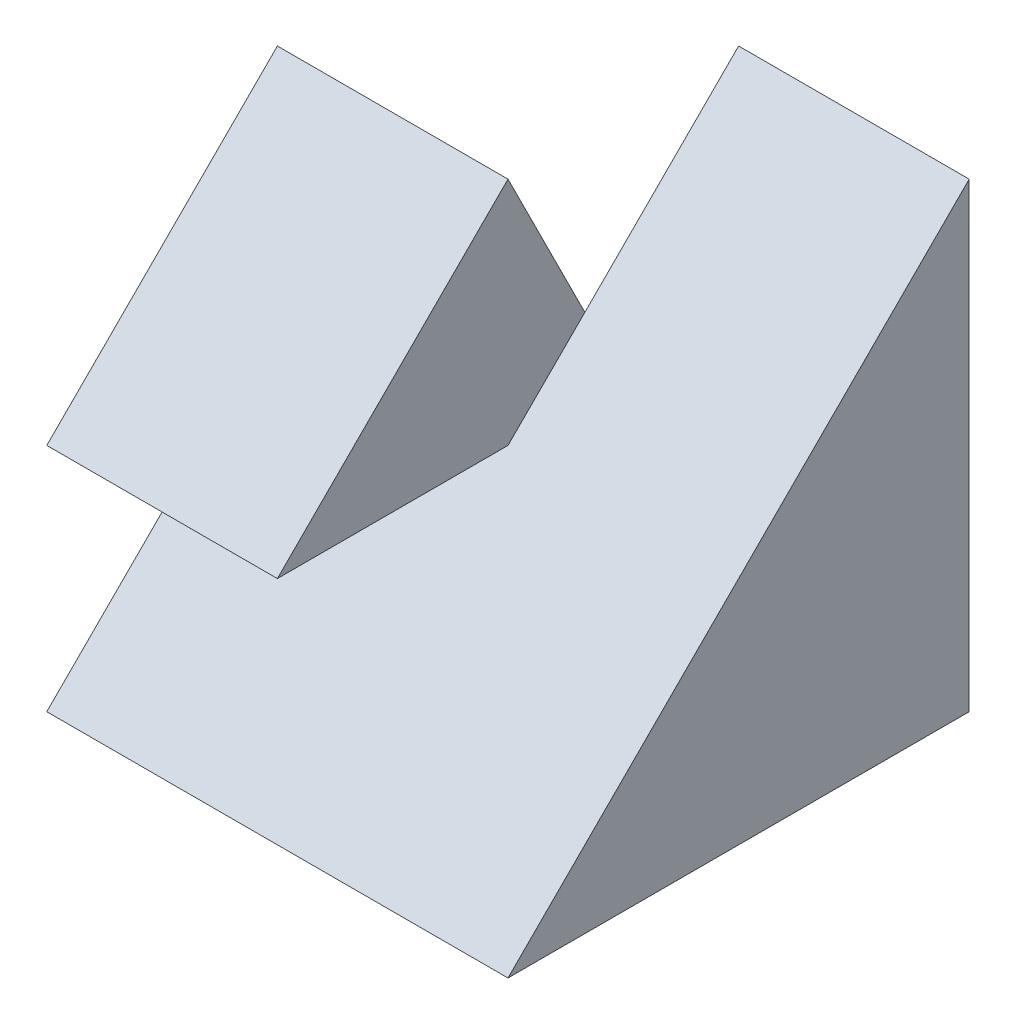
ISO-10303-21;
HEADER;
FILE_DESCRIPTION(('STEP AP214'),'2;1');
FILE_NAME('part.step','',(''),(''),'','','');
FILE_SCHEMA(('AUTOMOTIVE_DESIGN { 1 0 10303 214 1 1 1 1 }'));
ENDSEC;
DATA;
#1=APPLICATION_CONTEXT('core data for automotive mechanical design processes');
#2=APPLICATION_PROTOCOL_DEFINITION('international standard','automotive_design',2000,#1);
#3=PRODUCT_CONTEXT('',#1,'mechanical');
#4=PRODUCT('Part','Part','',(#3));
#5=PRODUCT_RELATED_PRODUCT_CATEGORY('part','',(#4));
#6=PRODUCT_DEFINITION_FORMATION('','',#4);
#7=PRODUCT_DEFINITION_CONTEXT('part definition',#1,'design');
#8=PRODUCT_DEFINITION('design','',#6,#7);
#9=PRODUCT_DEFINITION_SHAPE('','',#8);
#10=(LENGTH_UNIT() NAMED_UNIT(*) SI_UNIT(.MILLI.,.METRE.));
#11=(NAMED_UNIT(*) PLANE_ANGLE_UNIT() SI_UNIT($,.RADIAN.));
#12=(NAMED_UNIT(*) SI_UNIT($,.STERADIAN.) SOLID_ANGLE_UNIT());
#13=UNCERTAINTY_MEASURE_WITH_UNIT(LENGTH_MEASURE(1.E-05),#10,'distance_accuracy_value','');
#14=(GEOMETRIC_REPRESENTATION_CONTEXT(3) GLOBAL_UNCERTAINTY_ASSIGNED_CONTEXT((#13)) GLOBAL_UNIT_ASSIGNED_CONTEXT((#10,
#11,#12)) REPRESENTATION_CONTEXT('',''));
#15=CARTESIAN_POINT('',(0.,0.,0.));
#16=DIRECTION('',(0.,0.,1.));
#17=DIRECTION('',(1.,0.,0.));
#18=AXIS2_PLACEMENT_3D('',#15,#16,#17);
#19=CARTESIAN_POINT('',(-2.,4.,2.));
#20=DIRECTION('',(1.,0.,0.));
#21=DIRECTION('',(0.,0.,-1.));
#22=AXIS2_PLACEMENT_3D('',#19,#20,#21);
#23=PLANE('',#22);
#24=DIRECTION('',(0.,0.707106781186548,-0.707106781186548));
#25=VECTOR('',#24,1.);
#26=CARTESIAN_POINT('',(-2.,2.,2.));
#27=LINE('',#26,#25);
#28=CARTESIAN_POINT('',(-2.,1.99999999999999,2.));
#29=VERTEX_POINT('',#28);
#30=CARTESIAN_POINT('',(-2.,4.,0.));
#31=VERTEX_POINT('',#30);
#32=EDGE_CURVE('E169',#29,#31,#27,.T.);
#33=ORIENTED_EDGE('',*,*,#32,.T.);
#34=DIRECTION('',(0.,-0.894427190999916,-0.447213595499958));
#35=VECTOR('',#34,1.);
#36=CARTESIAN_POINT('',(-2.,0.8,-1.6));
#37=LINE('',#36,#35);
#38=CARTESIAN_POINT('',(-2.,0.,-2.));
#39=VERTEX_POINT('',#38);
#40=EDGE_CURVE('E137',#31,#39,#37,.T.);
#41=ORIENTED_EDGE('',*,*,#40,.T.);
#42=DIRECTION('',(0.,0.,1.));
#43=VECTOR('',#42,1.);
#44=CARTESIAN_POINT('',(-2.,0.,2.));
#45=LINE('',#44,#43);
#46=CARTESIAN_POINT('',(-2.,0.,2.));
#47=VERTEX_POINT('',#46);
#48=EDGE_CURVE('E156',#39,#47,#45,.T.);
#49=ORIENTED_EDGE('',*,*,#48,.T.);
#50=DIRECTION('',(0.,0.707106781186544,-0.707106781186551));
#51=VECTOR('',#50,1.);
#52=CARTESIAN_POINT('',(-2.,1.,0.999999999999989));
#53=LINE('',#52,#51);
#54=CARTESIAN_POINT('',(-2.,1.99999999999998,0.));
#55=VERTEX_POINT('',#54);
#56=EDGE_CURVE('E73',#47,#55,#53,.T.);
#57=ORIENTED_EDGE('',*,*,#56,.T.);
#58=DIRECTION('',(0.,0.,1.));
#59=VECTOR('',#58,1.);
#60=CARTESIAN_POINT('',(-2.,1.99999999999998,0.));
#61=LINE('',#60,#59);
#62=EDGE_CURVE('E132',#55,#29,#61,.T.);
#63=ORIENTED_EDGE('',*,*,#62,.T.);
#64=EDGE_LOOP('',(#33,#41,#49,#57,#63));
#65=FACE_BOUND('',#64,.T.);
#66=ADVANCED_FACE('F50',(#65),#23,.F.);
#67=CARTESIAN_POINT('',(-2.,4.,-2.));
#68=DIRECTION('',(0.,0.,1.));
#69=DIRECTION('',(1.,0.,0.));
#70=AXIS2_PLACEMENT_3D('',#67,#68,#69);
#71=PLANE('',#70);
#72=DIRECTION('',(0.,-1.,0.));
#73=VECTOR('',#72,1.);
#74=CARTESIAN_POINT('',(0.,0.,-2.));
#75=LINE('',#74,#73);
#76=CARTESIAN_POINT('',(0.,4.,-2.));
#77=VERTEX_POINT('',#76);
#78=CARTESIAN_POINT('',(0.,0.,-2.));
#79=VERTEX_POINT('',#78);
#80=EDGE_CURVE('E122',#77,#79,#75,.T.);
#81=ORIENTED_EDGE('',*,*,#80,.F.);
#82=DIRECTION('',(-1.,0.,0.));
#83=VECTOR('',#82,1.);
#84=CARTESIAN_POINT('',(-2.,4.,-2.));
#85=LINE('',#84,#83);
#86=CARTESIAN_POINT('',(2.,4.,-2.));
#87=VERTEX_POINT('',#86);
#88=EDGE_CURVE('E58',#87,#77,#85,.T.);
#89=ORIENTED_EDGE('',*,*,#88,.F.);
#90=DIRECTION('',(0.,-1.,0.));
#91=VECTOR('',#90,1.);
#92=CARTESIAN_POINT('',(2.,4.,-2.));
#93=LINE('',#92,#91);
#94=CARTESIAN_POINT('',(2.,0.,-2.));
#95=VERTEX_POINT('',#94);
#96=EDGE_CURVE('E12',#87,#95,#93,.T.);
#97=ORIENTED_EDGE('',*,*,#96,.T.);
#98=DIRECTION('',(-1.,0.,0.));
#99=VECTOR('',#98,1.);
#100=CARTESIAN_POINT('',(-2.,0.,-2.));
#101=LINE('',#100,#99);
#102=EDGE_CURVE('E128',#95,#79,#101,.T.);
#103=ORIENTED_EDGE('',*,*,#102,.T.);
#104=EDGE_LOOP('',(#81,#89,#97,#103));
#105=FACE_BOUND('',#104,.T.);
#106=ADVANCED_FACE('F127',(#105),#71,.F.);
#107=CARTESIAN_POINT('',(2.,4.,2.));
#108=DIRECTION('',(-1.,0.,0.));
#109=DIRECTION('',(0.,0.,1.));
#110=AXIS2_PLACEMENT_3D('',#107,#108,#109);
#111=PLANE('',#110);
#112=ORIENTED_EDGE('',*,*,#96,.F.);
#113=DIRECTION('',(0.,0.707106781186548,-0.707106781186548));
#114=VECTOR('',#113,1.);
#115=CARTESIAN_POINT('',(2.,0.,2.));
#116=LINE('',#115,#114);
#117=CARTESIAN_POINT('',(2.,0.,2.));
#118=VERTEX_POINT('',#117);
#119=EDGE_CURVE('E114',#118,#87,#116,.T.);
#120=ORIENTED_EDGE('',*,*,#119,.F.);
#121=DIRECTION('',(0.,0.,-1.));
#122=VECTOR('',#121,1.);
#123=CARTESIAN_POINT('',(2.,0.,2.));
#124=LINE('',#123,#122);
#125=EDGE_CURVE('E151',#118,#95,#124,.T.);
#126=ORIENTED_EDGE('',*,*,#125,.T.);
#127=EDGE_LOOP('',(#112,#120,#126));
#128=FACE_BOUND('',#127,.T.);
#129=ADVANCED_FACE('F52',(#128),#111,.F.);
#130=CARTESIAN_POINT('',(0.,0.,0.));
#131=DIRECTION('',(0.,-1.,0.));
#132=DIRECTION('',(0.,0.,-1.));
#133=AXIS2_PLACEMENT_3D('',#130,#131,#132);
#134=PLANE('',#133);
#135=ORIENTED_EDGE('',*,*,#125,.F.);
#136=DIRECTION('',(1.,0.,0.));
#137=VECTOR('',#136,1.);
#138=CARTESIAN_POINT('',(-2.,0.,2.));
#139=LINE('',#138,#137);
#140=EDGE_CURVE('E118',#47,#118,#139,.T.);
#141=ORIENTED_EDGE('',*,*,#140,.F.);
#142=ORIENTED_EDGE('',*,*,#48,.F.);
#143=DIRECTION('',(-1.,0.,0.));
#144=VECTOR('',#143,1.);
#145=CARTESIAN_POINT('',(0.,0.,-2.));
#146=LINE('',#145,#144);
#147=EDGE_CURVE('E129',#79,#39,#146,.T.);
#148=ORIENTED_EDGE('',*,*,#147,.F.);
#149=ORIENTED_EDGE('',*,*,#102,.F.);
#150=EDGE_LOOP('',(#135,#141,#142,#148,#149));
#151=FACE_BOUND('',#150,.T.);
#152=ADVANCED_FACE('F163',(#151),#134,.T.);
#153=CARTESIAN_POINT('',(0.,1.99999999999998,0.));
#154=DIRECTION('',(0.,-1.,0.));
#155=DIRECTION('',(0.,0.,-1.));
#156=AXIS2_PLACEMENT_3D('',#153,#154,#155);
#157=PLANE('',#156);
#158=ORIENTED_EDGE('',*,*,#62,.F.);
#159=DIRECTION('',(-1.,0.,0.));
#160=VECTOR('',#159,1.);
#161=CARTESIAN_POINT('',(0.,1.99999999999998,0.));
#162=LINE('',#161,#160);
#163=CARTESIAN_POINT('',(0.,1.99999999999999,0.));
#164=VERTEX_POINT('',#163);
#165=EDGE_CURVE('E144',#164,#55,#162,.T.);
#166=ORIENTED_EDGE('',*,*,#165,.F.);
#167=DIRECTION('',(0.,0.,1.));
#168=VECTOR('',#167,1.);
#169=CARTESIAN_POINT('',(0.,1.99999999999998,0.));
#170=LINE('',#169,#168);
#171=CARTESIAN_POINT('',(0.,1.99999999999999,2.));
#172=VERTEX_POINT('',#171);
#173=EDGE_CURVE('E141',#164,#172,#170,.T.);
#174=ORIENTED_EDGE('',*,*,#173,.T.);
#175=DIRECTION('',(-1.,0.,0.));
#176=VECTOR('',#175,1.);
#177=CARTESIAN_POINT('',(0.,1.99999999999999,2.));
#178=LINE('',#177,#176);
#179=EDGE_CURVE('E148',#172,#29,#178,.T.);
#180=ORIENTED_EDGE('',*,*,#179,.T.);
#181=EDGE_LOOP('',(#158,#166,#174,#180));
#182=FACE_BOUND('',#181,.T.);
#183=ADVANCED_FACE('F182',(#182),#157,.T.);
#184=CARTESIAN_POINT('',(0.,1.,0.999999999999989));
#185=DIRECTION('',(0.,0.707106781186551,0.707106781186544));
#186=DIRECTION('',(0.,-0.707106781186544,0.707106781186551));
#187=AXIS2_PLACEMENT_3D('',#184,#185,#186);
#188=PLANE('',#187);
#189=ORIENTED_EDGE('',*,*,#56,.F.);
#190=ORIENTED_EDGE('',*,*,#140,.T.);
#191=ORIENTED_EDGE('',*,*,#119,.T.);
#192=ORIENTED_EDGE('',*,*,#88,.T.);
#193=DIRECTION('',(0.,0.707106781186548,-0.707106781186548));
#194=VECTOR('',#193,1.);
#195=CARTESIAN_POINT('',(0.,0.,2.));
#196=LINE('',#195,#194);
#197=CARTESIAN_POINT('',(0.,2.66666666666667,-0.666666666666667));
#198=VERTEX_POINT('',#197);
#199=EDGE_CURVE('E111',#198,#77,#196,.T.);
#200=ORIENTED_EDGE('',*,*,#199,.F.);
#201=EDGE_CURVE('E124',#164,#198,#196,.T.);
#202=ORIENTED_EDGE('',*,*,#201,.F.);
#203=ORIENTED_EDGE('',*,*,#165,.T.);
#204=EDGE_LOOP('',(#189,#190,#191,#192,#200,#202,#203));
#205=FACE_BOUND('',#204,.T.);
#206=ADVANCED_FACE('F109',(#205),#188,.T.);
#207=CARTESIAN_POINT('',(0.,0.8,-1.6));
#208=DIRECTION('',(0.,0.447213595499958,-0.894427190999916));
#209=DIRECTION('',(0.,0.894427190999916,0.447213595499958));
#210=AXIS2_PLACEMENT_3D('',#207,#208,#209);
#211=PLANE('',#210);
#212=ORIENTED_EDGE('',*,*,#40,.F.);
#213=DIRECTION('',(-1.,0.,0.));
#214=VECTOR('',#213,1.);
#215=CARTESIAN_POINT('',(0.,4.,0.));
#216=LINE('',#215,#214);
#217=CARTESIAN_POINT('',(0.,4.,0.));
#218=VERTEX_POINT('',#217);
#219=EDGE_CURVE('E139',#218,#31,#216,.T.);
#220=ORIENTED_EDGE('',*,*,#219,.F.);
#221=DIRECTION('',(0.,-0.894427190999916,-0.447213595499958));
#222=VECTOR('',#221,1.);
#223=CARTESIAN_POINT('',(0.,0.8,-1.6));
#224=LINE('',#223,#222);
#225=EDGE_CURVE('E130',#218,#198,#224,.T.);
#226=ORIENTED_EDGE('',*,*,#225,.T.);
#227=EDGE_CURVE('E65',#198,#79,#224,.T.);
#228=ORIENTED_EDGE('',*,*,#227,.T.);
#229=ORIENTED_EDGE('',*,*,#147,.T.);
#230=EDGE_LOOP('',(#212,#220,#226,#228,#229));
#231=FACE_BOUND('',#230,.T.);
#232=ADVANCED_FACE('F165',(#231),#211,.T.);
#233=CARTESIAN_POINT('',(0.,0.,0.));
#234=DIRECTION('',(-1.,0.,0.));
#235=DIRECTION('',(0.,0.,1.));
#236=AXIS2_PLACEMENT_3D('',#233,#234,#235);
#237=PLANE('',#236);
#238=ORIENTED_EDGE('',*,*,#199,.T.);
#239=ORIENTED_EDGE('',*,*,#80,.T.);
#240=ORIENTED_EDGE('',*,*,#227,.F.);
#241=EDGE_LOOP('',(#238,#239,#240));
#242=FACE_BOUND('',#241,.T.);
#243=ADVANCED_FACE('F121',(#242),#237,.T.);
#244=CARTESIAN_POINT('',(0.,2.,2.));
#245=DIRECTION('',(0.,0.707106781186547,0.707106781186547));
#246=DIRECTION('',(0.,-0.707106781186548,0.707106781186548));
#247=AXIS2_PLACEMENT_3D('',#244,#245,#246);
#248=PLANE('',#247);
#249=ORIENTED_EDGE('',*,*,#32,.F.);
#250=ORIENTED_EDGE('',*,*,#179,.F.);
#251=DIRECTION('',(0.,0.707106781186548,-0.707106781186548));
#252=VECTOR('',#251,1.);
#253=CARTESIAN_POINT('',(0.,2.,2.));
#254=LINE('',#253,#252);
#255=EDGE_CURVE('E173',#172,#218,#254,.T.);
#256=ORIENTED_EDGE('',*,*,#255,.T.);
#257=ORIENTED_EDGE('',*,*,#219,.T.);
#258=EDGE_LOOP('',(#249,#250,#256,#257));
#259=FACE_BOUND('',#258,.T.);
#260=ADVANCED_FACE('F177',(#259),#248,.T.);
#261=CARTESIAN_POINT('',(0.,0.,0.));
#262=DIRECTION('',(-1.,0.,0.));
#263=DIRECTION('',(0.,0.,1.));
#264=AXIS2_PLACEMENT_3D('',#261,#262,#263);
#265=PLANE('',#264);
#266=ORIENTED_EDGE('',*,*,#173,.F.);
#267=ORIENTED_EDGE('',*,*,#201,.T.);
#268=ORIENTED_EDGE('',*,*,#225,.F.);
#269=ORIENTED_EDGE('',*,*,#255,.F.);
#270=EDGE_LOOP('',(#266,#267,#268,#269));
#271=FACE_BOUND('',#270,.T.);
#272=ADVANCED_FACE('F179',(#271),#265,.F.);
#273=CLOSED_SHELL('',(#66,#106,#129,#152,#183,#206,#232,#243,#260,#272));
#274=MANIFOLD_SOLID_BREP('B2',#273);
#275=ADVANCED_BREP_SHAPE_REPRESENTATION('',(#18,#274),#14);
#276=SHAPE_DEFINITION_REPRESENTATION(#9,#275);
ENDSEC;
END-ISO-10303-21;
